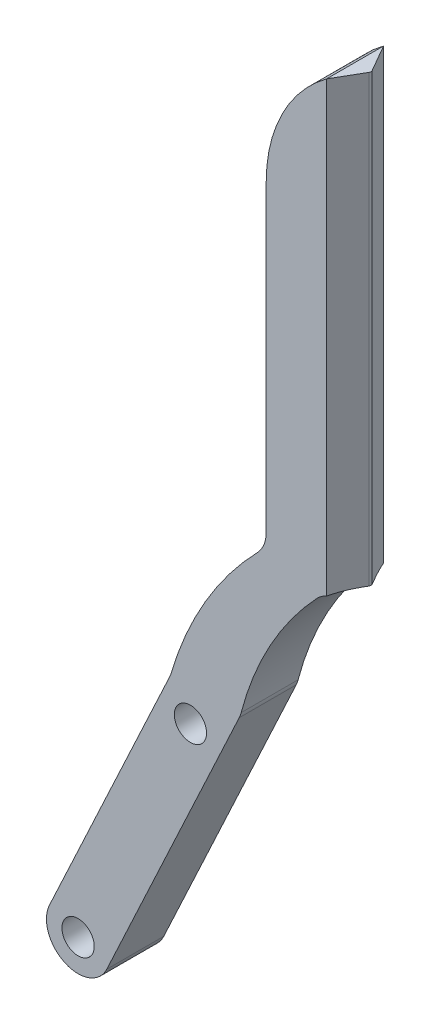
ISO-10303-21;
HEADER;
FILE_DESCRIPTION(('STEP AP214'),'2;1');
FILE_NAME('part.step','',(''),(''),'','','');
FILE_SCHEMA(('AUTOMOTIVE_DESIGN { 1 0 10303 214 1 1 1 1 }'));
ENDSEC;
DATA;
#1=APPLICATION_CONTEXT('core data for automotive mechanical design processes');
#2=APPLICATION_PROTOCOL_DEFINITION('international standard','automotive_design',2000,#1);
#3=PRODUCT_CONTEXT('',#1,'mechanical');
#4=PRODUCT('Part','Part','',(#3));
#5=PRODUCT_RELATED_PRODUCT_CATEGORY('part','',(#4));
#6=PRODUCT_DEFINITION_FORMATION('','',#4);
#7=PRODUCT_DEFINITION_CONTEXT('part definition',#1,'design');
#8=PRODUCT_DEFINITION('design','',#6,#7);
#9=PRODUCT_DEFINITION_SHAPE('','',#8);
#10=(LENGTH_UNIT() NAMED_UNIT(*) SI_UNIT(.MILLI.,.METRE.));
#11=(NAMED_UNIT(*) PLANE_ANGLE_UNIT() SI_UNIT($,.RADIAN.));
#12=(NAMED_UNIT(*) SI_UNIT($,.STERADIAN.) SOLID_ANGLE_UNIT());
#13=UNCERTAINTY_MEASURE_WITH_UNIT(LENGTH_MEASURE(1.E-05),#10,'distance_accuracy_value','');
#14=(GEOMETRIC_REPRESENTATION_CONTEXT(3) GLOBAL_UNCERTAINTY_ASSIGNED_CONTEXT((#13)) GLOBAL_UNIT_ASSIGNED_CONTEXT((#10,
#11,#12)) REPRESENTATION_CONTEXT('',''));
#15=CARTESIAN_POINT('',(0.,0.,0.));
#16=DIRECTION('',(0.,0.,1.));
#17=DIRECTION('',(1.,0.,0.));
#18=AXIS2_PLACEMENT_3D('',#15,#16,#17);
#19=CARTESIAN_POINT('',(48.4814127480708,-12.2291707793782,9.));
#20=DIRECTION('',(0.,0.,-1.));
#21=DIRECTION('',(-1.,0.,0.));
#22=AXIS2_PLACEMENT_3D('',#19,#20,#21);
#23=PLANE('',#22);
#24=DIRECTION('',(0.4226182617407,0.90630778703665,0.));
#25=VECTOR('',#24,1.);
#26=CARTESIAN_POINT('',(-21.1134867093291,-45.2780183642428,9.));
#27=LINE('',#26,#25);
#28=CARTESIAN_POINT('',(-21.1134867093291,-45.2780183642428,9.));
#29=VERTEX_POINT('',#28);
#30=CARTESIAN_POINT('',(-0.195723428152213,-0.419730246178272,9.));
#31=VERTEX_POINT('',#30);
#32=EDGE_CURVE('E188',#29,#31,#27,.T.);
#33=ORIENTED_EDGE('',*,*,#32,.T.);
#34=CARTESIAN_POINT('',(-4.72726236333546,1.69336106252522,9.));
#35=DIRECTION('',(0.,0.,-1.));
#36=DIRECTION('',(-1.,0.,0.));
#37=AXIS2_PLACEMENT_3D('',#34,#35,#36);
#38=CIRCLE('',#37,5.);
#39=CARTESIAN_POINT('',(0.10988991951965,0.427676349624916,9.));
#40=VERTEX_POINT('',#39);
#41=EDGE_CURVE('E233',#31,#40,#38,.F.);
#42=ORIENTED_EDGE('',*,*,#41,.T.);
#43=CARTESIAN_POINT('',(48.4814127480708,-12.2291707793782,9.));
#44=DIRECTION('',(0.,0.,-1.));
#45=DIRECTION('',(-1.,0.,0.));
#46=AXIS2_PLACEMENT_3D('',#43,#44,#45);
#47=CIRCLE('',#46,50.);
#48=CARTESIAN_POINT('',(12.0571919764426,22.0239479279701,9.));
#49=VERTEX_POINT('',#48);
#50=EDGE_CURVE('E174',#40,#49,#47,.T.);
#51=ORIENTED_EDGE('',*,*,#50,.T.);
#52=CARTESIAN_POINT('',(15.6996140536055,18.5986360572353,9.));
#53=DIRECTION('',(0.,0.,-1.));
#54=DIRECTION('',(-1.,0.,0.));
#55=AXIS2_PLACEMENT_3D('',#52,#53,#54);
#56=CIRCLE('',#55,5.);
#57=CARTESIAN_POINT('',(13.604941348597,23.138718243594,9.));
#58=VERTEX_POINT('',#57);
#59=EDGE_CURVE('E166',#49,#58,#56,.T.);
#60=ORIENTED_EDGE('',*,*,#59,.T.);
#61=DIRECTION('',(0.,-1.,0.));
#62=VECTOR('',#61,1.);
#63=CARTESIAN_POINT('',(13.604941348597,94.9,9.));
#64=LINE('',#63,#62);
#65=CARTESIAN_POINT('',(13.604941348597,93.8805356590532,9.));
#66=VERTEX_POINT('',#65);
#67=EDGE_CURVE('E58',#66,#58,#64,.T.);
#68=ORIENTED_EDGE('',*,*,#67,.F.);
#69=CARTESIAN_POINT('',(27.5333990910037,75.,9.));
#70=DIRECTION('',(0.,0.,1.));
#71=DIRECTION('',(-1.,0.,0.));
#72=AXIS2_PLACEMENT_3D('',#69,#70,#71);
#73=CIRCLE('',#72,23.4622369320317);
#74=CARTESIAN_POINT('',(4.07116215897206,75.,9.));
#75=VERTEX_POINT('',#74);
#76=EDGE_CURVE('E163',#66,#75,#73,.T.);
#77=ORIENTED_EDGE('',*,*,#76,.T.);
#78=DIRECTION('',(0.,-1.,0.));
#79=VECTOR('',#78,1.);
#80=CARTESIAN_POINT('',(4.07116215897206,25.,9.));
#81=LINE('',#80,#79);
#82=CARTESIAN_POINT('',(4.07116215897206,27.0773859993355,9.));
#83=VERTEX_POINT('',#82);
#84=EDGE_CURVE('E173',#75,#83,#81,.T.);
#85=ORIENTED_EDGE('',*,*,#84,.T.);
#86=CARTESIAN_POINT('',(-0.928837841027944,27.0773859993355,9.));
#87=DIRECTION('',(0.,0.,-1.));
#88=DIRECTION('',(-1.,0.,0.));
#89=AXIS2_PLACEMENT_3D('',#86,#87,#88);
#90=CIRCLE('',#89,5.);
#91=CARTESIAN_POINT('',(2.65978377327978,23.5957491846571,9.));
#92=VERTEX_POINT('',#91);
#93=EDGE_CURVE('E11',#83,#92,#90,.T.);
#94=ORIENTED_EDGE('',*,*,#93,.T.);
#95=CARTESIAN_POINT('',(43.1149270637192,-15.6533362194756,9.));
#96=DIRECTION('',(0.,0.,1.));
#97=DIRECTION('',(-1.,0.,0.));
#98=AXIS2_PLACEMENT_3D('',#95,#96,#97);
#99=CIRCLE('',#98,56.3658524614938);
#100=CARTESIAN_POINT('',(-10.9315668173999,0.349345520440497,9.));
#101=VERTEX_POINT('',#100);
#102=EDGE_CURVE('E176',#92,#101,#99,.T.);
#103=ORIENTED_EDGE('',*,*,#102,.T.);
#104=CARTESIAN_POINT('',(-15.7258253552302,1.7688824422717,9.));
#105=DIRECTION('',(0.,0.,-1.));
#106=DIRECTION('',(-1.,0.,0.));
#107=AXIS2_PLACEMENT_3D('',#104,#105,#106);
#108=CIRCLE('',#107,5.);
#109=CARTESIAN_POINT('',(-11.1942864200469,-0.344208866431805,9.));
#110=VERTEX_POINT('',#109);
#111=EDGE_CURVE('E256',#101,#110,#108,.T.);
#112=ORIENTED_EDGE('',*,*,#111,.T.);
#113=DIRECTION('',(-0.4226182617407,-0.90630778703665,0.));
#114=VECTOR('',#113,1.);
#115=CARTESIAN_POINT('',(-11.0337791896249,0.,9.));
#116=LINE('',#115,#114);
#117=CARTESIAN_POINT('',(-30.1765645796956,-41.0518357468358,9.));
#118=VERTEX_POINT('',#117);
#119=EDGE_CURVE('E184',#110,#118,#116,.T.);
#120=ORIENTED_EDGE('',*,*,#119,.T.);
#121=CARTESIAN_POINT('',(-25.6450256445124,-43.1649270555393,9.));
#122=DIRECTION('',(0.,0.,1.));
#123=DIRECTION('',(1.,0.,0.));
#124=AXIS2_PLACEMENT_3D('',#121,#122,#123);
#125=CIRCLE('',#124,5.);
#126=EDGE_CURVE('E186',#118,#29,#125,.T.);
#127=ORIENTED_EDGE('',*,*,#126,.T.);
#128=EDGE_LOOP('',(#33,#42,#51,#60,#68,#77,#85,#94,#103,#112,#120,#127));
#129=FACE_BOUND('',#128,.T.);
#130=CARTESIAN_POINT('',(-7.89505865140302,-5.1,9.));
#131=DIRECTION('',(0.,0.,1.));
#132=DIRECTION('',(1.,0.,0.));
#133=AXIS2_PLACEMENT_3D('',#130,#131,#132);
#134=CIRCLE('',#133,2.55);
#135=CARTESIAN_POINT('',(-5.34505865140302,-5.1,9.));
#136=VERTEX_POINT('',#135);
#137=EDGE_CURVE('E195',#136,#136,#134,.T.);
#138=ORIENTED_EDGE('',*,*,#137,.F.);
#139=EDGE_LOOP('',(#138));
#140=FACE_BOUND('',#139,.T.);
#141=CARTESIAN_POINT('',(-25.6450256445124,-43.1649270555393,9.));
#142=DIRECTION('',(0.,0.,1.));
#143=DIRECTION('',(1.,0.,0.));
#144=AXIS2_PLACEMENT_3D('',#141,#142,#143);
#145=CIRCLE('',#144,2.55);
#146=CARTESIAN_POINT('',(-23.0950256445124,-43.1649270555393,9.));
#147=VERTEX_POINT('',#146);
#148=EDGE_CURVE('E314',#147,#147,#145,.T.);
#149=ORIENTED_EDGE('',*,*,#148,.F.);
#150=EDGE_LOOP('',(#149));
#151=FACE_BOUND('',#150,.T.);
#152=ADVANCED_FACE('F35',(#129,#140,#151),#23,.F.);
#153=CARTESIAN_POINT('',(48.4814127480708,-12.2291707793782,0.));
#154=DIRECTION('',(0.,0.,-1.));
#155=DIRECTION('',(-1.,0.,0.));
#156=AXIS2_PLACEMENT_3D('',#153,#154,#155);
#157=PLANE('',#156);
#158=CARTESIAN_POINT('',(48.4814127480708,-12.2291707793782,0.));
#159=DIRECTION('',(0.,0.,-1.));
#160=DIRECTION('',(-1.,0.,0.));
#161=AXIS2_PLACEMENT_3D('',#158,#159,#160);
#162=CIRCLE('',#161,50.);
#163=CARTESIAN_POINT('',(0.10988991951965,0.427676349624916,0.));
#164=VERTEX_POINT('',#163);
#165=CARTESIAN_POINT('',(12.0571919764426,22.0239479279701,0.));
#166=VERTEX_POINT('',#165);
#167=EDGE_CURVE('E191',#164,#166,#162,.T.);
#168=ORIENTED_EDGE('',*,*,#167,.F.);
#169=CARTESIAN_POINT('',(-4.72726236333546,1.69336106252522,0.));
#170=DIRECTION('',(0.,0.,-1.));
#171=DIRECTION('',(-1.,0.,0.));
#172=AXIS2_PLACEMENT_3D('',#169,#170,#171);
#173=CIRCLE('',#172,5.);
#174=CARTESIAN_POINT('',(-0.195723428152213,-0.419730246178272,0.));
#175=VERTEX_POINT('',#174);
#176=EDGE_CURVE('E229',#164,#175,#173,.T.);
#177=ORIENTED_EDGE('',*,*,#176,.T.);
#178=DIRECTION('',(0.4226182617407,0.90630778703665,0.));
#179=VECTOR('',#178,1.);
#180=CARTESIAN_POINT('',(-21.1134867093291,-45.2780183642428,0.));
#181=LINE('',#180,#179);
#182=CARTESIAN_POINT('',(-21.1134867093291,-45.2780183642428,0.));
#183=VERTEX_POINT('',#182);
#184=EDGE_CURVE('E178',#183,#175,#181,.T.);
#185=ORIENTED_EDGE('',*,*,#184,.F.);
#186=CARTESIAN_POINT('',(-25.6450256445124,-43.1649270555393,0.));
#187=DIRECTION('',(0.,0.,1.));
#188=DIRECTION('',(1.,0.,0.));
#189=AXIS2_PLACEMENT_3D('',#186,#187,#188);
#190=CIRCLE('',#189,5.);
#191=CARTESIAN_POINT('',(-30.1765645796956,-41.0518357468358,0.));
#192=VERTEX_POINT('',#191);
#193=EDGE_CURVE('E205',#192,#183,#190,.T.);
#194=ORIENTED_EDGE('',*,*,#193,.F.);
#195=DIRECTION('',(-0.4226182617407,-0.90630778703665,0.));
#196=VECTOR('',#195,1.);
#197=CARTESIAN_POINT('',(-11.0337791896249,0.,0.));
#198=LINE('',#197,#196);
#199=CARTESIAN_POINT('',(-11.1942864200469,-0.344208866431805,0.));
#200=VERTEX_POINT('',#199);
#201=EDGE_CURVE('E203',#200,#192,#198,.T.);
#202=ORIENTED_EDGE('',*,*,#201,.F.);
#203=CARTESIAN_POINT('',(-15.7258253552302,1.7688824422717,0.));
#204=DIRECTION('',(0.,0.,-1.));
#205=DIRECTION('',(-1.,0.,0.));
#206=AXIS2_PLACEMENT_3D('',#203,#204,#205);
#207=CIRCLE('',#206,5.);
#208=CARTESIAN_POINT('',(-10.9315668173999,0.349345520440497,0.));
#209=VERTEX_POINT('',#208);
#210=EDGE_CURVE('E254',#200,#209,#207,.F.);
#211=ORIENTED_EDGE('',*,*,#210,.T.);
#212=CARTESIAN_POINT('',(43.1149270637192,-15.6533362194756,0.));
#213=DIRECTION('',(0.,0.,1.));
#214=DIRECTION('',(-1.,0.,0.));
#215=AXIS2_PLACEMENT_3D('',#212,#213,#214);
#216=CIRCLE('',#215,56.3658524614938);
#217=CARTESIAN_POINT('',(2.65978377327978,23.5957491846571,0.));
#218=VERTEX_POINT('',#217);
#219=EDGE_CURVE('E200',#218,#209,#216,.T.);
#220=ORIENTED_EDGE('',*,*,#219,.F.);
#221=CARTESIAN_POINT('',(-0.928837841027944,27.0773859993355,0.));
#222=DIRECTION('',(0.,0.,-1.));
#223=DIRECTION('',(-1.,0.,0.));
#224=AXIS2_PLACEMENT_3D('',#221,#222,#223);
#225=CIRCLE('',#224,5.);
#226=CARTESIAN_POINT('',(4.07116215897206,27.0773859993355,0.));
#227=VERTEX_POINT('',#226);
#228=EDGE_CURVE('E43',#218,#227,#225,.F.);
#229=ORIENTED_EDGE('',*,*,#228,.T.);
#230=DIRECTION('',(0.,-1.,0.));
#231=VECTOR('',#230,1.);
#232=CARTESIAN_POINT('',(4.07116215897206,25.,0.));
#233=LINE('',#232,#231);
#234=CARTESIAN_POINT('',(4.07116215897206,75.,0.));
#235=VERTEX_POINT('',#234);
#236=EDGE_CURVE('E197',#235,#227,#233,.T.);
#237=ORIENTED_EDGE('',*,*,#236,.F.);
#238=CARTESIAN_POINT('',(27.5333990910037,75.,0.));
#239=DIRECTION('',(0.,0.,1.));
#240=DIRECTION('',(-1.,0.,0.));
#241=AXIS2_PLACEMENT_3D('',#238,#239,#240);
#242=CIRCLE('',#241,23.4622369320317);
#243=CARTESIAN_POINT('',(13.604941348597,93.8805356590532,0.));
#244=VERTEX_POINT('',#243);
#245=EDGE_CURVE('E194',#244,#235,#242,.T.);
#246=ORIENTED_EDGE('',*,*,#245,.F.);
#247=DIRECTION('',(0.,-1.,0.));
#248=VECTOR('',#247,1.);
#249=CARTESIAN_POINT('',(13.604941348597,94.9,0.));
#250=LINE('',#249,#248);
#251=CARTESIAN_POINT('',(13.604941348597,23.138718243594,0.));
#252=VERTEX_POINT('',#251);
#253=EDGE_CURVE('E50',#244,#252,#250,.T.);
#254=ORIENTED_EDGE('',*,*,#253,.T.);
#255=CARTESIAN_POINT('',(15.6996140536055,18.5986360572353,0.));
#256=DIRECTION('',(0.,0.,-1.));
#257=DIRECTION('',(-1.,0.,0.));
#258=AXIS2_PLACEMENT_3D('',#255,#256,#257);
#259=CIRCLE('',#258,5.);
#260=EDGE_CURVE('E252',#252,#166,#259,.F.);
#261=ORIENTED_EDGE('',*,*,#260,.T.);
#262=EDGE_LOOP('',(#168,#177,#185,#194,#202,#211,#220,#229,#237,#246,#254,#261));
#263=FACE_BOUND('',#262,.T.);
#264=CARTESIAN_POINT('',(-7.89505865140302,-5.1,0.));
#265=DIRECTION('',(0.,0.,1.));
#266=DIRECTION('',(1.,0.,0.));
#267=AXIS2_PLACEMENT_3D('',#264,#265,#266);
#268=CIRCLE('',#267,2.55);
#269=CARTESIAN_POINT('',(-5.34505865140302,-5.1,0.));
#270=VERTEX_POINT('',#269);
#271=EDGE_CURVE('E317',#270,#270,#268,.T.);
#272=ORIENTED_EDGE('',*,*,#271,.T.);
#273=EDGE_LOOP('',(#272));
#274=FACE_BOUND('',#273,.T.);
#275=CARTESIAN_POINT('',(-25.6450256445124,-43.1649270555393,0.));
#276=DIRECTION('',(0.,0.,1.));
#277=DIRECTION('',(1.,0.,0.));
#278=AXIS2_PLACEMENT_3D('',#275,#276,#277);
#279=CIRCLE('',#278,2.55);
#280=CARTESIAN_POINT('',(-23.0950256445124,-43.1649270555393,0.));
#281=VERTEX_POINT('',#280);
#282=EDGE_CURVE('E312',#281,#281,#279,.T.);
#283=ORIENTED_EDGE('',*,*,#282,.T.);
#284=EDGE_LOOP('',(#283));
#285=FACE_BOUND('',#284,.T.);
#286=ADVANCED_FACE('F260',(#263,#274,#285),#157,.T.);
#287=CARTESIAN_POINT('',(48.4814127480708,-12.2291707793782,9.));
#288=DIRECTION('',(0.,0.,-1.));
#289=DIRECTION('',(-1.,0.,0.));
#290=AXIS2_PLACEMENT_3D('',#287,#288,#289);
#291=CYLINDRICAL_SURFACE('',#290,50.);
#292=ORIENTED_EDGE('',*,*,#50,.F.);
#293=DIRECTION('',(0.,0.,-1.));
#294=VECTOR('',#293,1.);
#295=CARTESIAN_POINT('',(0.10988991951965,0.427676349624916,9.));
#296=LINE('',#295,#294);
#297=EDGE_CURVE('E226',#40,#164,#296,.T.);
#298=ORIENTED_EDGE('',*,*,#297,.T.);
#299=ORIENTED_EDGE('',*,*,#167,.T.);
#300=DIRECTION('',(0.,0.,-1.));
#301=VECTOR('',#300,1.);
#302=CARTESIAN_POINT('',(12.0571919764426,22.0239479279701,9.));
#303=LINE('',#302,#301);
#304=EDGE_CURVE('E223',#166,#49,#303,.F.);
#305=ORIENTED_EDGE('',*,*,#304,.T.);
#306=EDGE_LOOP('',(#292,#298,#299,#305));
#307=FACE_BOUND('',#306,.T.);
#308=ADVANCED_FACE('F295',(#307),#291,.F.);
#309=CARTESIAN_POINT('',(27.5333990910037,75.,9.));
#310=DIRECTION('',(0.,0.,-1.));
#311=DIRECTION('',(-1.,0.,0.));
#312=AXIS2_PLACEMENT_3D('',#309,#310,#311);
#313=CYLINDRICAL_SURFACE('',#312,23.4622369320317);
#314=ORIENTED_EDGE('',*,*,#76,.F.);
#315=DIRECTION('',(0.,0.,-1.));
#316=VECTOR('',#315,1.);
#317=CARTESIAN_POINT('',(13.604941348597,93.8805356590532,9.));
#318=LINE('',#317,#316);
#319=EDGE_CURVE('E152',#66,#244,#318,.T.);
#320=ORIENTED_EDGE('',*,*,#319,.T.);
#321=ORIENTED_EDGE('',*,*,#245,.T.);
#322=DIRECTION('',(0.,0.,-1.));
#323=VECTOR('',#322,1.);
#324=CARTESIAN_POINT('',(4.07116215897206,75.,9.));
#325=LINE('',#324,#323);
#326=EDGE_CURVE('E157',#75,#235,#325,.T.);
#327=ORIENTED_EDGE('',*,*,#326,.F.);
#328=EDGE_LOOP('',(#314,#320,#321,#327));
#329=FACE_BOUND('',#328,.T.);
#330=ADVANCED_FACE('F170',(#329),#313,.T.);
#331=CARTESIAN_POINT('',(4.07116215897206,25.,9.));
#332=DIRECTION('',(1.,0.,0.));
#333=DIRECTION('',(0.,0.,-1.));
#334=AXIS2_PLACEMENT_3D('',#331,#332,#333);
#335=PLANE('',#334);
#336=ORIENTED_EDGE('',*,*,#236,.T.);
#337=DIRECTION('',(0.,0.,1.));
#338=VECTOR('',#337,1.);
#339=CARTESIAN_POINT('',(4.07116215897206,27.0773859993355,9.));
#340=LINE('',#339,#338);
#341=EDGE_CURVE('E245',#227,#83,#340,.T.);
#342=ORIENTED_EDGE('',*,*,#341,.T.);
#343=ORIENTED_EDGE('',*,*,#84,.F.);
#344=ORIENTED_EDGE('',*,*,#326,.T.);
#345=EDGE_LOOP('',(#336,#342,#343,#344));
#346=FACE_BOUND('',#345,.T.);
#347=ADVANCED_FACE('F266',(#346),#335,.F.);
#348=CARTESIAN_POINT('',(43.1149270637192,-15.6533362194756,9.));
#349=DIRECTION('',(0.,0.,-1.));
#350=DIRECTION('',(-1.,0.,0.));
#351=AXIS2_PLACEMENT_3D('',#348,#349,#350);
#352=CYLINDRICAL_SURFACE('',#351,56.3658524614938);
#353=ORIENTED_EDGE('',*,*,#219,.T.);
#354=DIRECTION('',(0.,0.,-1.));
#355=VECTOR('',#354,1.);
#356=CARTESIAN_POINT('',(-10.9315668174,0.349345520440497,9.));
#357=LINE('',#356,#355);
#358=EDGE_CURVE('E243',#209,#101,#357,.F.);
#359=ORIENTED_EDGE('',*,*,#358,.T.);
#360=ORIENTED_EDGE('',*,*,#102,.F.);
#361=DIRECTION('',(0.,0.,-1.));
#362=VECTOR('',#361,1.);
#363=CARTESIAN_POINT('',(2.65978377327977,23.5957491846571,9.));
#364=LINE('',#363,#362);
#365=EDGE_CURVE('E240',#92,#218,#364,.T.);
#366=ORIENTED_EDGE('',*,*,#365,.T.);
#367=EDGE_LOOP('',(#353,#359,#360,#366));
#368=FACE_BOUND('',#367,.T.);
#369=ADVANCED_FACE('F271',(#368),#352,.T.);
#370=CARTESIAN_POINT('',(-11.0337791896249,0.,9.));
#371=DIRECTION('',(0.90630778703665,-0.4226182617407,0.));
#372=DIRECTION('',(0.4226182617407,0.90630778703665,0.));
#373=AXIS2_PLACEMENT_3D('',#370,#371,#372);
#374=PLANE('',#373);
#375=ORIENTED_EDGE('',*,*,#119,.F.);
#376=DIRECTION('',(0.,0.,1.));
#377=VECTOR('',#376,1.);
#378=CARTESIAN_POINT('',(-11.1942864200469,-0.344208866431805,0.));
#379=LINE('',#378,#377);
#380=EDGE_CURVE('E237',#110,#200,#379,.F.);
#381=ORIENTED_EDGE('',*,*,#380,.T.);
#382=ORIENTED_EDGE('',*,*,#201,.T.);
#383=DIRECTION('',(0.,0.,-1.));
#384=VECTOR('',#383,1.);
#385=CARTESIAN_POINT('',(-30.1765645796956,-41.0518357468358,9.));
#386=LINE('',#385,#384);
#387=EDGE_CURVE('E211',#118,#192,#386,.T.);
#388=ORIENTED_EDGE('',*,*,#387,.F.);
#389=EDGE_LOOP('',(#375,#381,#382,#388));
#390=FACE_BOUND('',#389,.T.);
#391=ADVANCED_FACE('F279',(#390),#374,.F.);
#392=CARTESIAN_POINT('',(-25.6450256445124,-43.1649270555393,9.));
#393=DIRECTION('',(0.,0.,-1.));
#394=DIRECTION('',(-1.,0.,0.));
#395=AXIS2_PLACEMENT_3D('',#392,#393,#394);
#396=CYLINDRICAL_SURFACE('',#395,5.);
#397=ORIENTED_EDGE('',*,*,#193,.T.);
#398=DIRECTION('',(0.,0.,-1.));
#399=VECTOR('',#398,1.);
#400=CARTESIAN_POINT('',(-21.1134867093291,-45.2780183642428,9.));
#401=LINE('',#400,#399);
#402=EDGE_CURVE('E190',#29,#183,#401,.T.);
#403=ORIENTED_EDGE('',*,*,#402,.F.);
#404=ORIENTED_EDGE('',*,*,#126,.F.);
#405=ORIENTED_EDGE('',*,*,#387,.T.);
#406=EDGE_LOOP('',(#397,#403,#404,#405));
#407=FACE_BOUND('',#406,.T.);
#408=ADVANCED_FACE('F285',(#407),#396,.T.);
#409=CARTESIAN_POINT('',(-21.1134867093291,-45.2780183642428,9.));
#410=DIRECTION('',(-0.90630778703665,0.4226182617407,0.));
#411=DIRECTION('',(-0.4226182617407,-0.90630778703665,0.));
#412=AXIS2_PLACEMENT_3D('',#409,#410,#411);
#413=PLANE('',#412);
#414=ORIENTED_EDGE('',*,*,#184,.T.);
#415=DIRECTION('',(0.,0.,-1.));
#416=VECTOR('',#415,1.);
#417=CARTESIAN_POINT('',(-0.195723428152213,-0.419730246178272,9.));
#418=LINE('',#417,#416);
#419=EDGE_CURVE('E231',#175,#31,#418,.F.);
#420=ORIENTED_EDGE('',*,*,#419,.T.);
#421=ORIENTED_EDGE('',*,*,#32,.F.);
#422=ORIENTED_EDGE('',*,*,#402,.T.);
#423=EDGE_LOOP('',(#414,#420,#421,#422));
#424=FACE_BOUND('',#423,.T.);
#425=ADVANCED_FACE('F328',(#424),#413,.F.);
#426=CARTESIAN_POINT('',(-7.89505865140302,-5.1,9.));
#427=DIRECTION('',(0.,0.,-1.));
#428=DIRECTION('',(-1.,0.,0.));
#429=AXIS2_PLACEMENT_3D('',#426,#427,#428);
#430=CYLINDRICAL_SURFACE('',#429,2.55);
#431=ORIENTED_EDGE('',*,*,#137,.T.);
#432=EDGE_LOOP('',(#431));
#433=FACE_BOUND('',#432,.T.);
#434=ORIENTED_EDGE('',*,*,#271,.F.);
#435=EDGE_LOOP('',(#434));
#436=FACE_BOUND('',#435,.T.);
#437=ADVANCED_FACE('F325',(#433,#436),#430,.F.);
#438=CARTESIAN_POINT('',(-25.6450256445124,-43.1649270555393,9.));
#439=DIRECTION('',(0.,0.,-1.));
#440=DIRECTION('',(-1.,0.,0.));
#441=AXIS2_PLACEMENT_3D('',#438,#439,#440);
#442=CYLINDRICAL_SURFACE('',#441,2.55);
#443=ORIENTED_EDGE('',*,*,#148,.T.);
#444=EDGE_LOOP('',(#443));
#445=FACE_BOUND('',#444,.T.);
#446=ORIENTED_EDGE('',*,*,#282,.F.);
#447=EDGE_LOOP('',(#446));
#448=FACE_BOUND('',#447,.T.);
#449=ADVANCED_FACE('F327',(#445,#448),#442,.F.);
#450=CARTESIAN_POINT('',(13.604941348597,23.5986360572353,0.));
#451=DIRECTION('',(-0.866025403784438,0.,0.500000000000002));
#452=DIRECTION('',(0.500000000000002,0.,0.866025403784438));
#453=AXIS2_PLACEMENT_3D('',#450,#451,#452);
#454=PLANE('',#453);
#455=DIRECTION('',(0.500000000000002,0.,0.866025403784438));
#456=VECTOR('',#455,1.);
#457=CARTESIAN_POINT('',(13.604941348597,93.8805356590532,0.));
#458=LINE('',#457,#456);
#459=CARTESIAN_POINT('',(16.0586799926529,93.8805356590532,4.25));
#460=VERTEX_POINT('',#459);
#461=EDGE_CURVE('E148',#244,#460,#458,.T.);
#462=ORIENTED_EDGE('',*,*,#461,.T.);
#463=DIRECTION('',(0.,1.,0.));
#464=VECTOR('',#463,1.);
#465=CARTESIAN_POINT('',(16.0586799926529,23.5986360572353,4.25));
#466=LINE('',#465,#464);
#467=CARTESIAN_POINT('',(16.0586799926529,23.5986360572353,4.25));
#468=VERTEX_POINT('',#467);
#469=EDGE_CURVE('E218',#460,#468,#466,.F.);
#470=ORIENTED_EDGE('',*,*,#469,.T.);
#471=DIRECTION('',(0.500000000000002,0.,0.866025403784438));
#472=VECTOR('',#471,1.);
#473=CARTESIAN_POINT('',(13.604941348597,23.5986360572353,0.));
#474=LINE('',#473,#472);
#475=CARTESIAN_POINT('',(15.6996140536055,23.5986360572353,3.62807955030242));
#476=VERTEX_POINT('',#475);
#477=EDGE_CURVE('E147',#476,#468,#474,.T.);
#478=ORIENTED_EDGE('',*,*,#477,.F.);
#479=CARTESIAN_POINT('',(15.6996140536055,18.5986360572353,3.62807955030242));
#480=DIRECTION('',(-0.866025403784438,0.,0.500000000000002));
#481=DIRECTION('',(-0.500000000000002,0.,-0.866025403784438));
#482=AXIS2_PLACEMENT_3D('',#479,#480,#481);
#483=ELLIPSE('',#482,9.99999999999997,5.);
#484=EDGE_CURVE('E250',#476,#252,#483,.T.);
#485=ORIENTED_EDGE('',*,*,#484,.T.);
#486=ORIENTED_EDGE('',*,*,#253,.F.);
#487=EDGE_LOOP('',(#462,#470,#478,#485,#486));
#488=FACE_BOUND('',#487,.T.);
#489=ADVANCED_FACE('F335',(#488),#454,.F.);
#490=CARTESIAN_POINT('',(16.2030175599503,23.5986360572353,4.5));
#491=DIRECTION('',(-0.866025403784438,0.,-0.5));
#492=DIRECTION('',(-0.5,0.,0.866025403784438));
#493=AXIS2_PLACEMENT_3D('',#490,#491,#492);
#494=PLANE('',#493);
#495=DIRECTION('',(-0.5,0.,0.866025403784438));
#496=VECTOR('',#495,1.);
#497=CARTESIAN_POINT('',(16.2030175599503,23.5986360572353,4.5));
#498=LINE('',#497,#496);
#499=CARTESIAN_POINT('',(16.0586799926529,23.5986360572353,4.75));
#500=VERTEX_POINT('',#499);
#501=CARTESIAN_POINT('',(15.6996140536055,23.5986360572353,5.37192044969758));
#502=VERTEX_POINT('',#501);
#503=EDGE_CURVE('E168',#500,#502,#498,.T.);
#504=ORIENTED_EDGE('',*,*,#503,.F.);
#505=DIRECTION('',(0.,1.,0.));
#506=VECTOR('',#505,1.);
#507=CARTESIAN_POINT('',(16.0586799926529,23.5986360572353,4.75));
#508=LINE('',#507,#506);
#509=CARTESIAN_POINT('',(16.0586799926529,93.8805356590532,4.75));
#510=VERTEX_POINT('',#509);
#511=EDGE_CURVE('E145',#500,#510,#508,.T.);
#512=ORIENTED_EDGE('',*,*,#511,.T.);
#513=DIRECTION('',(-0.5,0.,0.866025403784438));
#514=VECTOR('',#513,1.);
#515=CARTESIAN_POINT('',(16.2030175599503,93.8805356590532,4.5));
#516=LINE('',#515,#514);
#517=EDGE_CURVE('E140',#510,#66,#516,.T.);
#518=ORIENTED_EDGE('',*,*,#517,.T.);
#519=ORIENTED_EDGE('',*,*,#67,.T.);
#520=CARTESIAN_POINT('',(15.6996140536055,18.5986360572353,5.37192044969758));
#521=DIRECTION('',(-0.866025403784438,0.,-0.5));
#522=DIRECTION('',(0.5,0.,-0.866025403784438));
#523=AXIS2_PLACEMENT_3D('',#520,#521,#522);
#524=ELLIPSE('',#523,9.99999999999999,5.);
#525=EDGE_CURVE('E248',#58,#502,#524,.T.);
#526=ORIENTED_EDGE('',*,*,#525,.T.);
#527=EDGE_LOOP('',(#504,#512,#518,#519,#526));
#528=FACE_BOUND('',#527,.T.);
#529=ADVANCED_FACE('F143',(#528),#494,.F.);
#530=CARTESIAN_POINT('',(0.,23.5986360572353,0.));
#531=DIRECTION('',(0.,-1.,0.));
#532=DIRECTION('',(0.,0.,-1.));
#533=AXIS2_PLACEMENT_3D('',#530,#531,#532);
#534=PLANE('',#533);
#535=ORIENTED_EDGE('',*,*,#503,.T.);
#536=DIRECTION('',(0.,0.,-1.));
#537=VECTOR('',#536,1.);
#538=CARTESIAN_POINT('',(15.6996140536055,23.5986360572353,0.));
#539=LINE('',#538,#537);
#540=EDGE_CURVE('E235',#502,#476,#539,.T.);
#541=ORIENTED_EDGE('',*,*,#540,.T.);
#542=ORIENTED_EDGE('',*,*,#477,.T.);
#543=CARTESIAN_POINT('',(15.6256672907607,23.5986360572353,4.5));
#544=DIRECTION('',(0.,-1.,0.));
#545=DIRECTION('',(0.,0.,-1.));
#546=AXIS2_PLACEMENT_3D('',#543,#544,#545);
#547=CIRCLE('',#546,0.5);
#548=EDGE_CURVE('E221',#468,#500,#547,.T.);
#549=ORIENTED_EDGE('',*,*,#548,.T.);
#550=EDGE_LOOP('',(#535,#541,#542,#549));
#551=FACE_BOUND('',#550,.T.);
#552=ADVANCED_FACE('F305',(#551),#534,.T.);
#553=CARTESIAN_POINT('',(0.,93.8805356590532,0.));
#554=DIRECTION('',(0.,-1.,0.));
#555=DIRECTION('',(0.,0.,-1.));
#556=AXIS2_PLACEMENT_3D('',#553,#554,#555);
#557=PLANE('',#556);
#558=ORIENTED_EDGE('',*,*,#517,.F.);
#559=CARTESIAN_POINT('',(15.6256672907607,93.8805356590532,4.5));
#560=DIRECTION('',(0.,-1.,0.));
#561=DIRECTION('',(0.,0.,-1.));
#562=AXIS2_PLACEMENT_3D('',#559,#560,#561);
#563=CIRCLE('',#562,0.5);
#564=EDGE_CURVE('E216',#510,#460,#563,.F.);
#565=ORIENTED_EDGE('',*,*,#564,.T.);
#566=ORIENTED_EDGE('',*,*,#461,.F.);
#567=ORIENTED_EDGE('',*,*,#319,.F.);
#568=EDGE_LOOP('',(#558,#565,#566,#567));
#569=FACE_BOUND('',#568,.T.);
#570=ADVANCED_FACE('F153',(#569),#557,.F.);
#571=CARTESIAN_POINT('',(15.6256672907607,23.5986360572353,4.5));
#572=DIRECTION('',(0.,1.,0.));
#573=DIRECTION('',(-1.,0.,0.));
#574=AXIS2_PLACEMENT_3D('',#571,#572,#573);
#575=CYLINDRICAL_SURFACE('',#574,0.5);
#576=ORIENTED_EDGE('',*,*,#548,.F.);
#577=ORIENTED_EDGE('',*,*,#469,.F.);
#578=ORIENTED_EDGE('',*,*,#564,.F.);
#579=ORIENTED_EDGE('',*,*,#511,.F.);
#580=EDGE_LOOP('',(#576,#577,#578,#579));
#581=FACE_BOUND('',#580,.T.);
#582=ADVANCED_FACE('F358',(#581),#575,.T.);
#583=CARTESIAN_POINT('',(-4.72726236333546,1.69336106252522,9.));
#584=DIRECTION('',(0.,0.,-1.));
#585=DIRECTION('',(-1.,0.,0.));
#586=AXIS2_PLACEMENT_3D('',#583,#584,#585);
#587=CYLINDRICAL_SURFACE('',#586,5.);
#588=ORIENTED_EDGE('',*,*,#41,.F.);
#589=ORIENTED_EDGE('',*,*,#419,.F.);
#590=ORIENTED_EDGE('',*,*,#176,.F.);
#591=ORIENTED_EDGE('',*,*,#297,.F.);
#592=EDGE_LOOP('',(#588,#589,#590,#591));
#593=FACE_BOUND('',#592,.T.);
#594=ADVANCED_FACE('F293',(#593),#587,.T.);
#595=CARTESIAN_POINT('',(15.6996140536055,18.5986360572353,9.));
#596=DIRECTION('',(0.,0.,-1.));
#597=DIRECTION('',(-1.,0.,0.));
#598=AXIS2_PLACEMENT_3D('',#595,#596,#597);
#599=CYLINDRICAL_SURFACE('',#598,5.);
#600=ORIENTED_EDGE('',*,*,#484,.F.);
#601=ORIENTED_EDGE('',*,*,#540,.F.);
#602=ORIENTED_EDGE('',*,*,#525,.F.);
#603=ORIENTED_EDGE('',*,*,#59,.F.);
#604=ORIENTED_EDGE('',*,*,#304,.F.);
#605=ORIENTED_EDGE('',*,*,#260,.F.);
#606=EDGE_LOOP('',(#600,#601,#602,#603,#604,#605));
#607=FACE_BOUND('',#606,.T.);
#608=ADVANCED_FACE('F301',(#607),#599,.F.);
#609=CARTESIAN_POINT('',(-15.7258253552302,1.7688824422717,9.));
#610=DIRECTION('',(0.,0.,-1.));
#611=DIRECTION('',(-1.,0.,0.));
#612=AXIS2_PLACEMENT_3D('',#609,#610,#611);
#613=CYLINDRICAL_SURFACE('',#612,5.);
#614=ORIENTED_EDGE('',*,*,#111,.F.);
#615=ORIENTED_EDGE('',*,*,#358,.F.);
#616=ORIENTED_EDGE('',*,*,#210,.F.);
#617=ORIENTED_EDGE('',*,*,#380,.F.);
#618=EDGE_LOOP('',(#614,#615,#616,#617));
#619=FACE_BOUND('',#618,.T.);
#620=ADVANCED_FACE('F274',(#619),#613,.F.);
#621=CARTESIAN_POINT('',(-0.928837841027944,27.0773859993355,9.));
#622=DIRECTION('',(0.,0.,-1.));
#623=DIRECTION('',(-1.,0.,0.));
#624=AXIS2_PLACEMENT_3D('',#621,#622,#623);
#625=CYLINDRICAL_SURFACE('',#624,5.);
#626=ORIENTED_EDGE('',*,*,#93,.F.);
#627=ORIENTED_EDGE('',*,*,#341,.F.);
#628=ORIENTED_EDGE('',*,*,#228,.F.);
#629=ORIENTED_EDGE('',*,*,#365,.F.);
#630=EDGE_LOOP('',(#626,#627,#628,#629));
#631=FACE_BOUND('',#630,.T.);
#632=ADVANCED_FACE('F37',(#631),#625,.F.);
#633=CLOSED_SHELL('',(#152,#286,#308,#330,#347,#369,#391,#408,#425,#437,#449,#489,#529,#552,
#570,#582,#594,#608,#620,#632));
#634=MANIFOLD_SOLID_BREP('B2',#633);
#635=ADVANCED_BREP_SHAPE_REPRESENTATION('',(#18,#634),#14);
#636=SHAPE_DEFINITION_REPRESENTATION(#9,#635);
ENDSEC;
END-ISO-10303-21;
